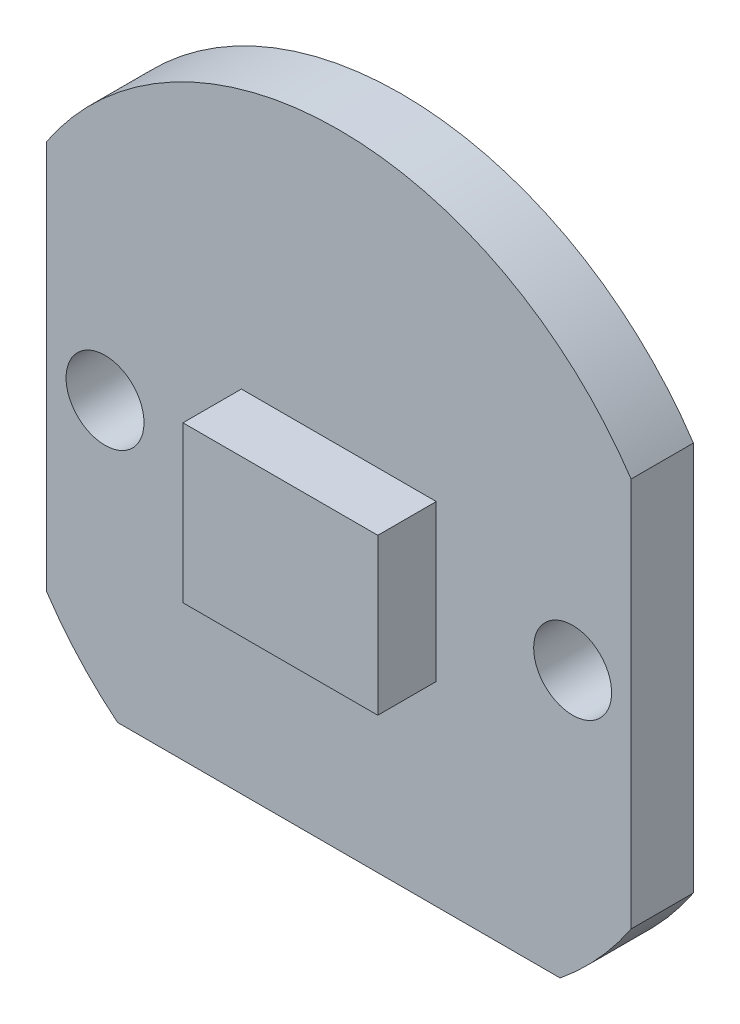
ISO-10303-21;
HEADER;
FILE_DESCRIPTION(('STEP AP214'),'2;1');
FILE_NAME('part.step','',(''),(''),'','','');
FILE_SCHEMA(('AUTOMOTIVE_DESIGN { 1 0 10303 214 1 1 1 1 }'));
ENDSEC;
DATA;
#1=APPLICATION_CONTEXT('core data for automotive mechanical design processes');
#2=APPLICATION_PROTOCOL_DEFINITION('international standard','automotive_design',2000,#1);
#3=PRODUCT_CONTEXT('',#1,'mechanical');
#4=PRODUCT('Part','Part','',(#3));
#5=PRODUCT_RELATED_PRODUCT_CATEGORY('part','',(#4));
#6=PRODUCT_DEFINITION_FORMATION('','',#4);
#7=PRODUCT_DEFINITION_CONTEXT('part definition',#1,'design');
#8=PRODUCT_DEFINITION('design','',#6,#7);
#9=PRODUCT_DEFINITION_SHAPE('','',#8);
#10=(LENGTH_UNIT() NAMED_UNIT(*) SI_UNIT(.MILLI.,.METRE.));
#11=(NAMED_UNIT(*) PLANE_ANGLE_UNIT() SI_UNIT($,.RADIAN.));
#12=(NAMED_UNIT(*) SI_UNIT($,.STERADIAN.) SOLID_ANGLE_UNIT());
#13=UNCERTAINTY_MEASURE_WITH_UNIT(LENGTH_MEASURE(1.E-05),#10,'distance_accuracy_value','');
#14=(GEOMETRIC_REPRESENTATION_CONTEXT(3) GLOBAL_UNCERTAINTY_ASSIGNED_CONTEXT((#13)) GLOBAL_UNIT_ASSIGNED_CONTEXT((#10,
#11,#12)) REPRESENTATION_CONTEXT('',''));
#15=CARTESIAN_POINT('',(0.,0.,0.));
#16=DIRECTION('',(0.,0.,1.));
#17=DIRECTION('',(1.,0.,0.));
#18=AXIS2_PLACEMENT_3D('',#15,#16,#17);
#19=CARTESIAN_POINT('',(0.,0.,1.6));
#20=DIRECTION('',(0.,0.,-1.));
#21=DIRECTION('',(-1.,0.,0.));
#22=AXIS2_PLACEMENT_3D('',#19,#20,#21);
#23=PLANE('',#22);
#24=CARTESIAN_POINT('',(-6.,0.,1.6));
#25=DIRECTION('',(0.,0.,1.));
#26=DIRECTION('',(1.,0.,0.));
#27=AXIS2_PLACEMENT_3D('',#24,#25,#26);
#28=CIRCLE('',#27,1.);
#29=CARTESIAN_POINT('',(-5.,0.,1.6));
#30=VERTEX_POINT('',#29);
#31=EDGE_CURVE('E191',#30,#30,#28,.T.);
#32=ORIENTED_EDGE('',*,*,#31,.F.);
#33=EDGE_LOOP('',(#32));
#34=FACE_BOUND('',#33,.T.);
#35=DIRECTION('',(0.,1.,0.));
#36=VECTOR('',#35,1.);
#37=CARTESIAN_POINT('',(-7.5,-5.,1.6));
#38=LINE('',#37,#36);
#39=CARTESIAN_POINT('',(-7.5,-5.,1.6));
#40=VERTEX_POINT('',#39);
#41=CARTESIAN_POINT('',(-7.5,5.,1.6));
#42=VERTEX_POINT('',#41);
#43=EDGE_CURVE('E197',#40,#42,#38,.T.);
#44=ORIENTED_EDGE('',*,*,#43,.F.);
#45=CARTESIAN_POINT('',(0.,0.,1.6));
#46=DIRECTION('',(0.,0.,1.));
#47=DIRECTION('',(1.,0.,0.));
#48=AXIS2_PLACEMENT_3D('',#45,#46,#47);
#49=CIRCLE('',#48,9.01387818865997);
#50=CARTESIAN_POINT('',(-5.67890834580027,-7.,1.6));
#51=VERTEX_POINT('',#50);
#52=EDGE_CURVE('E210',#40,#51,#49,.T.);
#53=ORIENTED_EDGE('',*,*,#52,.T.);
#54=DIRECTION('',(1.,0.,0.));
#55=VECTOR('',#54,1.);
#56=CARTESIAN_POINT('',(-5.67890834580027,-7.,1.6));
#57=LINE('',#56,#55);
#58=CARTESIAN_POINT('',(5.67890834580027,-7.,1.6));
#59=VERTEX_POINT('',#58);
#60=EDGE_CURVE('E208',#51,#59,#57,.T.);
#61=ORIENTED_EDGE('',*,*,#60,.T.);
#62=CARTESIAN_POINT('',(0.,0.,1.6));
#63=DIRECTION('',(0.,0.,1.));
#64=DIRECTION('',(1.,0.,0.));
#65=AXIS2_PLACEMENT_3D('',#62,#63,#64);
#66=CIRCLE('',#65,9.01387818865997);
#67=CARTESIAN_POINT('',(7.5,-5.,1.6));
#68=VERTEX_POINT('',#67);
#69=EDGE_CURVE('E206',#59,#68,#66,.T.);
#70=ORIENTED_EDGE('',*,*,#69,.T.);
#71=DIRECTION('',(0.,1.,0.));
#72=VECTOR('',#71,1.);
#73=CARTESIAN_POINT('',(7.5,-5.,1.6));
#74=LINE('',#73,#72);
#75=CARTESIAN_POINT('',(7.5,5.,1.6));
#76=VERTEX_POINT('',#75);
#77=EDGE_CURVE('E204',#68,#76,#74,.T.);
#78=ORIENTED_EDGE('',*,*,#77,.T.);
#79=CARTESIAN_POINT('',(0.,0.,1.6));
#80=DIRECTION('',(0.,0.,-1.));
#81=DIRECTION('',(-1.,0.,0.));
#82=AXIS2_PLACEMENT_3D('',#79,#80,#81);
#83=CIRCLE('',#82,9.01387818865997);
#84=EDGE_CURVE('E200',#42,#76,#83,.T.);
#85=ORIENTED_EDGE('',*,*,#84,.F.);
#86=EDGE_LOOP('',(#44,#53,#61,#70,#78,#85));
#87=FACE_BOUND('',#86,.T.);
#88=CARTESIAN_POINT('',(6.,0.,1.6));
#89=DIRECTION('',(0.,0.,-1.));
#90=DIRECTION('',(-1.,0.,0.));
#91=AXIS2_PLACEMENT_3D('',#88,#89,#90);
#92=CIRCLE('',#91,1.);
#93=CARTESIAN_POINT('',(5.,0.,1.6));
#94=VERTEX_POINT('',#93);
#95=EDGE_CURVE('E182',#94,#94,#92,.T.);
#96=ORIENTED_EDGE('',*,*,#95,.T.);
#97=EDGE_LOOP('',(#96));
#98=FACE_BOUND('',#97,.T.);
#99=DIRECTION('',(0.,1.,0.));
#100=VECTOR('',#99,1.);
#101=CARTESIAN_POINT('',(2.5,-2.,1.6));
#102=LINE('',#101,#100);
#103=CARTESIAN_POINT('',(2.5,-2.,1.6));
#104=VERTEX_POINT('',#103);
#105=CARTESIAN_POINT('',(2.5,2.,1.6));
#106=VERTEX_POINT('',#105);
#107=EDGE_CURVE('E178',#104,#106,#102,.T.);
#108=ORIENTED_EDGE('',*,*,#107,.F.);
#109=DIRECTION('',(1.,0.,0.));
#110=VECTOR('',#109,1.);
#111=CARTESIAN_POINT('',(-2.5,-2.,1.6));
#112=LINE('',#111,#110);
#113=CARTESIAN_POINT('',(-2.5,-2.,1.6));
#114=VERTEX_POINT('',#113);
#115=EDGE_CURVE('E175',#114,#104,#112,.T.);
#116=ORIENTED_EDGE('',*,*,#115,.F.);
#117=DIRECTION('',(0.,-1.,0.));
#118=VECTOR('',#117,1.);
#119=CARTESIAN_POINT('',(-2.5,-2.,1.6));
#120=LINE('',#119,#118);
#121=CARTESIAN_POINT('',(-2.5,2.,1.6));
#122=VERTEX_POINT('',#121);
#123=EDGE_CURVE('E102',#122,#114,#120,.T.);
#124=ORIENTED_EDGE('',*,*,#123,.F.);
#125=DIRECTION('',(-1.,0.,0.));
#126=VECTOR('',#125,1.);
#127=CARTESIAN_POINT('',(-2.5,2.,1.6));
#128=LINE('',#127,#126);
#129=EDGE_CURVE('E97',#106,#122,#128,.T.);
#130=ORIENTED_EDGE('',*,*,#129,.F.);
#131=EDGE_LOOP('',(#108,#116,#124,#130));
#132=FACE_BOUND('',#131,.T.);
#133=ADVANCED_FACE('F80',(#34,#87,#98,#132),#23,.F.);
#134=CARTESIAN_POINT('',(0.,0.,0.));
#135=DIRECTION('',(0.,0.,-1.));
#136=DIRECTION('',(-1.,0.,0.));
#137=AXIS2_PLACEMENT_3D('',#134,#135,#136);
#138=PLANE('',#137);
#139=CARTESIAN_POINT('',(6.,0.,0.));
#140=DIRECTION('',(0.,0.,-1.));
#141=DIRECTION('',(-1.,0.,0.));
#142=AXIS2_PLACEMENT_3D('',#139,#140,#141);
#143=CIRCLE('',#142,1.);
#144=CARTESIAN_POINT('',(5.,0.,0.));
#145=VERTEX_POINT('',#144);
#146=EDGE_CURVE('E179',#145,#145,#143,.T.);
#147=ORIENTED_EDGE('',*,*,#146,.F.);
#148=EDGE_LOOP('',(#147));
#149=FACE_BOUND('',#148,.T.);
#150=DIRECTION('',(0.,1.,0.));
#151=VECTOR('',#150,1.);
#152=CARTESIAN_POINT('',(-7.5,-5.,0.));
#153=LINE('',#152,#151);
#154=CARTESIAN_POINT('',(-7.5,-5.,0.));
#155=VERTEX_POINT('',#154);
#156=CARTESIAN_POINT('',(-7.5,5.,0.));
#157=VERTEX_POINT('',#156);
#158=EDGE_CURVE('E194',#155,#157,#153,.T.);
#159=ORIENTED_EDGE('',*,*,#158,.T.);
#160=CARTESIAN_POINT('',(0.,0.,0.));
#161=DIRECTION('',(0.,0.,-1.));
#162=DIRECTION('',(-1.,0.,0.));
#163=AXIS2_PLACEMENT_3D('',#160,#161,#162);
#164=CIRCLE('',#163,9.01387818865997);
#165=CARTESIAN_POINT('',(7.5,5.,0.));
#166=VERTEX_POINT('',#165);
#167=EDGE_CURVE('E214',#157,#166,#164,.T.);
#168=ORIENTED_EDGE('',*,*,#167,.T.);
#169=DIRECTION('',(0.,1.,0.));
#170=VECTOR('',#169,1.);
#171=CARTESIAN_POINT('',(7.5,-5.,0.));
#172=LINE('',#171,#170);
#173=CARTESIAN_POINT('',(7.5,-5.,0.));
#174=VERTEX_POINT('',#173);
#175=EDGE_CURVE('E217',#174,#166,#172,.T.);
#176=ORIENTED_EDGE('',*,*,#175,.F.);
#177=CARTESIAN_POINT('',(0.,0.,0.));
#178=DIRECTION('',(0.,0.,1.));
#179=DIRECTION('',(1.,0.,0.));
#180=AXIS2_PLACEMENT_3D('',#177,#178,#179);
#181=CIRCLE('',#180,9.01387818865997);
#182=CARTESIAN_POINT('',(5.67890834580027,-7.,0.));
#183=VERTEX_POINT('',#182);
#184=EDGE_CURVE('E220',#183,#174,#181,.T.);
#185=ORIENTED_EDGE('',*,*,#184,.F.);
#186=DIRECTION('',(1.,0.,0.));
#187=VECTOR('',#186,1.);
#188=CARTESIAN_POINT('',(-5.67890834580027,-7.,0.));
#189=LINE('',#188,#187);
#190=CARTESIAN_POINT('',(-5.67890834580027,-7.,0.));
#191=VERTEX_POINT('',#190);
#192=EDGE_CURVE('E222',#191,#183,#189,.T.);
#193=ORIENTED_EDGE('',*,*,#192,.F.);
#194=CARTESIAN_POINT('',(0.,0.,0.));
#195=DIRECTION('',(0.,0.,1.));
#196=DIRECTION('',(1.,0.,0.));
#197=AXIS2_PLACEMENT_3D('',#194,#195,#196);
#198=CIRCLE('',#197,9.01387818865997);
#199=EDGE_CURVE('E201',#155,#191,#198,.T.);
#200=ORIENTED_EDGE('',*,*,#199,.F.);
#201=EDGE_LOOP('',(#159,#168,#176,#185,#193,#200));
#202=FACE_BOUND('',#201,.T.);
#203=CARTESIAN_POINT('',(-6.,0.,0.));
#204=DIRECTION('',(0.,0.,1.));
#205=DIRECTION('',(1.,0.,0.));
#206=AXIS2_PLACEMENT_3D('',#203,#204,#205);
#207=CIRCLE('',#206,1.);
#208=CARTESIAN_POINT('',(-5.,0.,0.));
#209=VERTEX_POINT('',#208);
#210=EDGE_CURVE('E189',#209,#209,#207,.T.);
#211=ORIENTED_EDGE('',*,*,#210,.T.);
#212=EDGE_LOOP('',(#211));
#213=FACE_BOUND('',#212,.T.);
#214=ADVANCED_FACE('F244',(#149,#202,#213),#138,.T.);
#215=CARTESIAN_POINT('',(-7.5,-5.,1.6));
#216=DIRECTION('',(-1.,0.,0.));
#217=DIRECTION('',(0.,0.,1.));
#218=AXIS2_PLACEMENT_3D('',#215,#216,#217);
#219=PLANE('',#218);
#220=ORIENTED_EDGE('',*,*,#158,.F.);
#221=DIRECTION('',(0.,0.,-1.));
#222=VECTOR('',#221,1.);
#223=CARTESIAN_POINT('',(-7.5,-5.,1.6));
#224=LINE('',#223,#222);
#225=EDGE_CURVE('E12',#40,#155,#224,.T.);
#226=ORIENTED_EDGE('',*,*,#225,.F.);
#227=ORIENTED_EDGE('',*,*,#43,.T.);
#228=DIRECTION('',(0.,0.,-1.));
#229=VECTOR('',#228,1.);
#230=CARTESIAN_POINT('',(-7.5,5.,1.6));
#231=LINE('',#230,#229);
#232=EDGE_CURVE('E84',#42,#157,#231,.T.);
#233=ORIENTED_EDGE('',*,*,#232,.T.);
#234=EDGE_LOOP('',(#220,#226,#227,#233));
#235=FACE_BOUND('',#234,.T.);
#236=ADVANCED_FACE('F82',(#235),#219,.T.);
#237=CARTESIAN_POINT('',(0.,0.,1.6));
#238=DIRECTION('',(0.,0.,-1.));
#239=DIRECTION('',(-1.,0.,0.));
#240=AXIS2_PLACEMENT_3D('',#237,#238,#239);
#241=CYLINDRICAL_SURFACE('',#240,9.01387818865997);
#242=ORIENTED_EDGE('',*,*,#199,.T.);
#243=DIRECTION('',(0.,0.,-1.));
#244=VECTOR('',#243,1.);
#245=CARTESIAN_POINT('',(-5.67890834580027,-7.,1.6));
#246=LINE('',#245,#244);
#247=EDGE_CURVE('E89',#51,#191,#246,.T.);
#248=ORIENTED_EDGE('',*,*,#247,.F.);
#249=ORIENTED_EDGE('',*,*,#52,.F.);
#250=ORIENTED_EDGE('',*,*,#225,.T.);
#251=EDGE_LOOP('',(#242,#248,#249,#250));
#252=FACE_BOUND('',#251,.T.);
#253=ADVANCED_FACE('F250',(#252),#241,.T.);
#254=CARTESIAN_POINT('',(-5.67890834580027,-7.,1.6));
#255=DIRECTION('',(0.,1.,0.));
#256=DIRECTION('',(0.,0.,1.));
#257=AXIS2_PLACEMENT_3D('',#254,#255,#256);
#258=PLANE('',#257);
#259=ORIENTED_EDGE('',*,*,#192,.T.);
#260=DIRECTION('',(0.,0.,-1.));
#261=VECTOR('',#260,1.);
#262=CARTESIAN_POINT('',(5.67890834580027,-7.,1.6));
#263=LINE('',#262,#261);
#264=EDGE_CURVE('E227',#59,#183,#263,.T.);
#265=ORIENTED_EDGE('',*,*,#264,.F.);
#266=ORIENTED_EDGE('',*,*,#60,.F.);
#267=ORIENTED_EDGE('',*,*,#247,.T.);
#268=EDGE_LOOP('',(#259,#265,#266,#267));
#269=FACE_BOUND('',#268,.T.);
#270=ADVANCED_FACE('F254',(#269),#258,.F.);
#271=CARTESIAN_POINT('',(0.,0.,1.6));
#272=DIRECTION('',(0.,0.,-1.));
#273=DIRECTION('',(-1.,0.,0.));
#274=AXIS2_PLACEMENT_3D('',#271,#272,#273);
#275=CYLINDRICAL_SURFACE('',#274,9.01387818865997);
#276=ORIENTED_EDGE('',*,*,#184,.T.);
#277=DIRECTION('',(0.,0.,-1.));
#278=VECTOR('',#277,1.);
#279=CARTESIAN_POINT('',(7.5,-5.,1.6));
#280=LINE('',#279,#278);
#281=EDGE_CURVE('E230',#68,#174,#280,.T.);
#282=ORIENTED_EDGE('',*,*,#281,.F.);
#283=ORIENTED_EDGE('',*,*,#69,.F.);
#284=ORIENTED_EDGE('',*,*,#264,.T.);
#285=EDGE_LOOP('',(#276,#282,#283,#284));
#286=FACE_BOUND('',#285,.T.);
#287=ADVANCED_FACE('F264',(#286),#275,.T.);
#288=CARTESIAN_POINT('',(7.5,-5.,1.6));
#289=DIRECTION('',(-1.,0.,0.));
#290=DIRECTION('',(0.,0.,1.));
#291=AXIS2_PLACEMENT_3D('',#288,#289,#290);
#292=PLANE('',#291);
#293=ORIENTED_EDGE('',*,*,#175,.T.);
#294=DIRECTION('',(0.,0.,-1.));
#295=VECTOR('',#294,1.);
#296=CARTESIAN_POINT('',(7.5,5.,1.6));
#297=LINE('',#296,#295);
#298=EDGE_CURVE('E232',#76,#166,#297,.T.);
#299=ORIENTED_EDGE('',*,*,#298,.F.);
#300=ORIENTED_EDGE('',*,*,#77,.F.);
#301=ORIENTED_EDGE('',*,*,#281,.T.);
#302=EDGE_LOOP('',(#293,#299,#300,#301));
#303=FACE_BOUND('',#302,.T.);
#304=ADVANCED_FACE('F262',(#303),#292,.F.);
#305=CARTESIAN_POINT('',(0.,0.,1.6));
#306=DIRECTION('',(0.,0.,-1.));
#307=DIRECTION('',(-1.,0.,0.));
#308=AXIS2_PLACEMENT_3D('',#305,#306,#307);
#309=CYLINDRICAL_SURFACE('',#308,9.01387818865997);
#310=ORIENTED_EDGE('',*,*,#167,.F.);
#311=ORIENTED_EDGE('',*,*,#232,.F.);
#312=ORIENTED_EDGE('',*,*,#84,.T.);
#313=ORIENTED_EDGE('',*,*,#298,.T.);
#314=EDGE_LOOP('',(#310,#311,#312,#313));
#315=FACE_BOUND('',#314,.T.);
#316=ADVANCED_FACE('F240',(#315),#309,.T.);
#317=CARTESIAN_POINT('',(-6.,0.,1.6));
#318=DIRECTION('',(0.,0.,-1.));
#319=DIRECTION('',(-1.,0.,0.));
#320=AXIS2_PLACEMENT_3D('',#317,#318,#319);
#321=CYLINDRICAL_SURFACE('',#320,1.);
#322=ORIENTED_EDGE('',*,*,#31,.T.);
#323=EDGE_LOOP('',(#322));
#324=FACE_BOUND('',#323,.T.);
#325=ORIENTED_EDGE('',*,*,#210,.F.);
#326=EDGE_LOOP('',(#325));
#327=FACE_BOUND('',#326,.T.);
#328=ADVANCED_FACE('F283',(#324,#327),#321,.F.);
#329=CARTESIAN_POINT('',(6.,0.,1.6));
#330=DIRECTION('',(0.,0.,-1.));
#331=DIRECTION('',(-1.,0.,0.));
#332=AXIS2_PLACEMENT_3D('',#329,#330,#331);
#333=CYLINDRICAL_SURFACE('',#332,1.);
#334=ORIENTED_EDGE('',*,*,#95,.F.);
#335=EDGE_LOOP('',(#334));
#336=FACE_BOUND('',#335,.T.);
#337=ORIENTED_EDGE('',*,*,#146,.T.);
#338=EDGE_LOOP('',(#337));
#339=FACE_BOUND('',#338,.T.);
#340=ADVANCED_FACE('F339',(#336,#339),#333,.F.);
#341=CARTESIAN_POINT('',(2.5,-2.,3.1));
#342=DIRECTION('',(-1.,0.,0.));
#343=DIRECTION('',(0.,0.,1.));
#344=AXIS2_PLACEMENT_3D('',#341,#342,#343);
#345=PLANE('',#344);
#346=ORIENTED_EDGE('',*,*,#107,.T.);
#347=DIRECTION('',(0.,0.,-1.));
#348=VECTOR('',#347,1.);
#349=CARTESIAN_POINT('',(2.5,2.,3.1));
#350=LINE('',#349,#348);
#351=CARTESIAN_POINT('',(2.5,2.,3.1));
#352=VERTEX_POINT('',#351);
#353=EDGE_CURVE('E159',#352,#106,#350,.T.);
#354=ORIENTED_EDGE('',*,*,#353,.F.);
#355=DIRECTION('',(0.,1.,0.));
#356=VECTOR('',#355,1.);
#357=CARTESIAN_POINT('',(2.5,-2.,3.1));
#358=LINE('',#357,#356);
#359=CARTESIAN_POINT('',(2.5,-2.,3.1));
#360=VERTEX_POINT('',#359);
#361=EDGE_CURVE('E166',#360,#352,#358,.T.);
#362=ORIENTED_EDGE('',*,*,#361,.F.);
#363=DIRECTION('',(0.,0.,-1.));
#364=VECTOR('',#363,1.);
#365=CARTESIAN_POINT('',(2.5,-2.,3.1));
#366=LINE('',#365,#364);
#367=EDGE_CURVE('E401',#360,#104,#366,.T.);
#368=ORIENTED_EDGE('',*,*,#367,.T.);
#369=EDGE_LOOP('',(#346,#354,#362,#368));
#370=FACE_BOUND('',#369,.T.);
#371=ADVANCED_FACE('F177',(#370),#345,.F.);
#372=CARTESIAN_POINT('',(-2.5,2.,3.1));
#373=DIRECTION('',(0.,-1.,0.));
#374=DIRECTION('',(0.,0.,-1.));
#375=AXIS2_PLACEMENT_3D('',#372,#373,#374);
#376=PLANE('',#375);
#377=ORIENTED_EDGE('',*,*,#129,.T.);
#378=DIRECTION('',(0.,0.,-1.));
#379=VECTOR('',#378,1.);
#380=CARTESIAN_POINT('',(-2.5,2.,3.1));
#381=LINE('',#380,#379);
#382=CARTESIAN_POINT('',(-2.5,2.,3.1));
#383=VERTEX_POINT('',#382);
#384=EDGE_CURVE('E162',#383,#122,#381,.T.);
#385=ORIENTED_EDGE('',*,*,#384,.F.);
#386=DIRECTION('',(-1.,0.,0.));
#387=VECTOR('',#386,1.);
#388=CARTESIAN_POINT('',(-2.5,2.,3.1));
#389=LINE('',#388,#387);
#390=EDGE_CURVE('E155',#352,#383,#389,.T.);
#391=ORIENTED_EDGE('',*,*,#390,.F.);
#392=ORIENTED_EDGE('',*,*,#353,.T.);
#393=EDGE_LOOP('',(#377,#385,#391,#392));
#394=FACE_BOUND('',#393,.T.);
#395=ADVANCED_FACE('F157',(#394),#376,.F.);
#396=CARTESIAN_POINT('',(-2.5,-2.,3.1));
#397=DIRECTION('',(1.,0.,0.));
#398=DIRECTION('',(0.,0.,-1.));
#399=AXIS2_PLACEMENT_3D('',#396,#397,#398);
#400=PLANE('',#399);
#401=ORIENTED_EDGE('',*,*,#123,.T.);
#402=DIRECTION('',(0.,0.,-1.));
#403=VECTOR('',#402,1.);
#404=CARTESIAN_POINT('',(-2.5,-2.,3.1));
#405=LINE('',#404,#403);
#406=CARTESIAN_POINT('',(-2.5,-2.,3.1));
#407=VERTEX_POINT('',#406);
#408=EDGE_CURVE('E184',#407,#114,#405,.T.);
#409=ORIENTED_EDGE('',*,*,#408,.F.);
#410=DIRECTION('',(0.,-1.,0.));
#411=VECTOR('',#410,1.);
#412=CARTESIAN_POINT('',(-2.5,-2.,3.1));
#413=LINE('',#412,#411);
#414=EDGE_CURVE('E165',#383,#407,#413,.T.);
#415=ORIENTED_EDGE('',*,*,#414,.F.);
#416=ORIENTED_EDGE('',*,*,#384,.T.);
#417=EDGE_LOOP('',(#401,#409,#415,#416));
#418=FACE_BOUND('',#417,.T.);
#419=ADVANCED_FACE('F368',(#418),#400,.F.);
#420=CARTESIAN_POINT('',(-2.5,-2.,3.1));
#421=DIRECTION('',(0.,1.,0.));
#422=DIRECTION('',(0.,0.,1.));
#423=AXIS2_PLACEMENT_3D('',#420,#421,#422);
#424=PLANE('',#423);
#425=ORIENTED_EDGE('',*,*,#115,.T.);
#426=ORIENTED_EDGE('',*,*,#367,.F.);
#427=DIRECTION('',(1.,0.,0.));
#428=VECTOR('',#427,1.);
#429=CARTESIAN_POINT('',(-2.5,-2.,3.1));
#430=LINE('',#429,#428);
#431=EDGE_CURVE('E171',#407,#360,#430,.T.);
#432=ORIENTED_EDGE('',*,*,#431,.F.);
#433=ORIENTED_EDGE('',*,*,#408,.T.);
#434=EDGE_LOOP('',(#425,#426,#432,#433));
#435=FACE_BOUND('',#434,.T.);
#436=ADVANCED_FACE('F377',(#435),#424,.F.);
#437=CARTESIAN_POINT('',(0.,0.,3.1));
#438=DIRECTION('',(0.,0.,-1.));
#439=DIRECTION('',(-1.,0.,0.));
#440=AXIS2_PLACEMENT_3D('',#437,#438,#439);
#441=PLANE('',#440);
#442=ORIENTED_EDGE('',*,*,#361,.T.);
#443=ORIENTED_EDGE('',*,*,#390,.T.);
#444=ORIENTED_EDGE('',*,*,#414,.T.);
#445=ORIENTED_EDGE('',*,*,#431,.T.);
#446=EDGE_LOOP('',(#442,#443,#444,#445));
#447=FACE_BOUND('',#446,.T.);
#448=ADVANCED_FACE('F169',(#447),#441,.F.);
#449=CLOSED_SHELL('',(#133,#214,#236,#253,#270,#287,#304,#316,#328,#340,#371,#395,#419,#436,#448));
#450=MANIFOLD_SOLID_BREP('B2',#449);
#451=ADVANCED_BREP_SHAPE_REPRESENTATION('',(#18,#450),#14);
#452=SHAPE_DEFINITION_REPRESENTATION(#9,#451);
ENDSEC;
END-ISO-10303-21;
